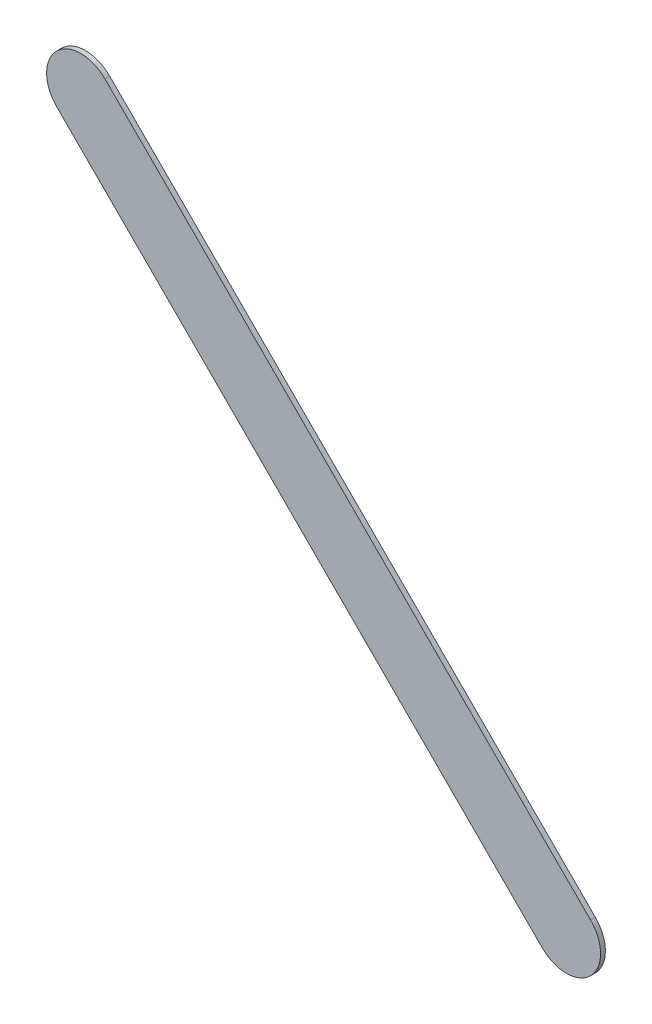
ISO-10303-21;
HEADER;
FILE_DESCRIPTION(('STEP AP214'),'2;1');
FILE_NAME('part.step','',(''),(''),'','','');
FILE_SCHEMA(('AUTOMOTIVE_DESIGN { 1 0 10303 214 1 1 1 1 }'));
ENDSEC;
DATA;
#1=APPLICATION_CONTEXT('core data for automotive mechanical design processes');
#2=APPLICATION_PROTOCOL_DEFINITION('international standard','automotive_design',2000,#1);
#3=PRODUCT_CONTEXT('',#1,'mechanical');
#4=PRODUCT('Part','Part','',(#3));
#5=PRODUCT_RELATED_PRODUCT_CATEGORY('part','',(#4));
#6=PRODUCT_DEFINITION_FORMATION('','',#4);
#7=PRODUCT_DEFINITION_CONTEXT('part definition',#1,'design');
#8=PRODUCT_DEFINITION('design','',#6,#7);
#9=PRODUCT_DEFINITION_SHAPE('','',#8);
#10=(LENGTH_UNIT() NAMED_UNIT(*) SI_UNIT(.MILLI.,.METRE.));
#11=(NAMED_UNIT(*) PLANE_ANGLE_UNIT() SI_UNIT($,.RADIAN.));
#12=(NAMED_UNIT(*) SI_UNIT($,.STERADIAN.) SOLID_ANGLE_UNIT());
#13=UNCERTAINTY_MEASURE_WITH_UNIT(LENGTH_MEASURE(1.E-05),#10,'distance_accuracy_value','');
#14=(GEOMETRIC_REPRESENTATION_CONTEXT(3) GLOBAL_UNCERTAINTY_ASSIGNED_CONTEXT((#13)) GLOBAL_UNIT_ASSIGNED_CONTEXT((#10,
#11,#12)) REPRESENTATION_CONTEXT('',''));
#15=CARTESIAN_POINT('',(0.,0.,0.));
#16=DIRECTION('',(0.,0.,1.));
#17=DIRECTION('',(1.,0.,0.));
#18=AXIS2_PLACEMENT_3D('',#15,#16,#17);
#19=CARTESIAN_POINT('',(148.512776,-91.263223,0.));
#20=DIRECTION('',(0.,0.,1.));
#21=DIRECTION('',(1.,0.,0.));
#22=AXIS2_PLACEMENT_3D('',#19,#20,#21);
#23=PLANE('',#22);
#24=DIRECTION('',(-0.707106781186548,0.707106781186548,0.));
#25=VECTOR('',#24,1.);
#26=CARTESIAN_POINT('',(148.512776,-91.263223,0.));
#27=LINE('',#26,#25);
#28=CARTESIAN_POINT('',(148.512776,-91.263223,0.));
#29=VERTEX_POINT('',#28);
#30=CARTESIAN_POINT('',(144.956776,-87.707223,0.));
#31=VERTEX_POINT('',#30);
#32=EDGE_CURVE('E74',#29,#31,#27,.T.);
#33=ORIENTED_EDGE('',*,*,#32,.T.);
#34=CARTESIAN_POINT('',(144.7799995,-87.8839995,0.));
#35=DIRECTION('',(0.,0.,1.));
#36=DIRECTION('',(0.707106781186548,0.707106781186548,0.));
#37=AXIS2_PLACEMENT_3D('',#34,#35,#36);
#38=CIRCLE('',#37,0.249999723809);
#39=CARTESIAN_POINT('',(144.603223,-88.060776,0.));
#40=VERTEX_POINT('',#39);
#41=EDGE_CURVE('E72',#31,#40,#38,.T.);
#42=ORIENTED_EDGE('',*,*,#41,.T.);
#43=DIRECTION('',(0.707106781186548,-0.707106781186548,0.));
#44=VECTOR('',#43,1.);
#45=CARTESIAN_POINT('',(144.603223,-88.060776,0.));
#46=LINE('',#45,#44);
#47=CARTESIAN_POINT('',(148.159223,-91.616776,0.));
#48=VERTEX_POINT('',#47);
#49=EDGE_CURVE('E60',#40,#48,#46,.T.);
#50=ORIENTED_EDGE('',*,*,#49,.T.);
#51=CARTESIAN_POINT('',(148.3359995,-91.4399995,0.));
#52=DIRECTION('',(0.,0.,1.));
#53=DIRECTION('',(-0.707106781186548,-0.707106781186548,0.));
#54=AXIS2_PLACEMENT_3D('',#51,#52,#53);
#55=CIRCLE('',#54,0.249999723809);
#56=EDGE_CURVE('E11',#48,#29,#55,.T.);
#57=ORIENTED_EDGE('',*,*,#56,.T.);
#58=EDGE_LOOP('',(#33,#42,#50,#57));
#59=FACE_BOUND('',#58,.T.);
#60=ADVANCED_FACE('F17',(#59),#23,.T.);
#61=CARTESIAN_POINT('',(148.512776,-91.263223,-0.035));
#62=DIRECTION('',(0.,0.,1.));
#63=DIRECTION('',(1.,0.,0.));
#64=AXIS2_PLACEMENT_3D('',#61,#62,#63);
#65=PLANE('',#64);
#66=CARTESIAN_POINT('',(148.3359995,-91.4399995,-0.035));
#67=DIRECTION('',(0.,0.,1.));
#68=DIRECTION('',(-0.707106781186548,-0.707106781186548,0.));
#69=AXIS2_PLACEMENT_3D('',#66,#67,#68);
#70=CIRCLE('',#69,0.249999723809);
#71=CARTESIAN_POINT('',(148.159223,-91.616776,-0.035));
#72=VERTEX_POINT('',#71);
#73=CARTESIAN_POINT('',(148.512776,-91.263223,-0.035));
#74=VERTEX_POINT('',#73);
#75=EDGE_CURVE('E26',#72,#74,#70,.T.);
#76=ORIENTED_EDGE('',*,*,#75,.F.);
#77=DIRECTION('',(0.707106781186548,-0.707106781186548,0.));
#78=VECTOR('',#77,1.);
#79=CARTESIAN_POINT('',(144.603223,-88.060776,-0.035));
#80=LINE('',#79,#78);
#81=CARTESIAN_POINT('',(144.603223,-88.060776,-0.035));
#82=VERTEX_POINT('',#81);
#83=EDGE_CURVE('E79',#82,#72,#80,.T.);
#84=ORIENTED_EDGE('',*,*,#83,.F.);
#85=CARTESIAN_POINT('',(144.7799995,-87.8839995,-0.035));
#86=DIRECTION('',(0.,0.,1.));
#87=DIRECTION('',(0.707106781186548,0.707106781186548,0.));
#88=AXIS2_PLACEMENT_3D('',#85,#86,#87);
#89=CIRCLE('',#88,0.249999723809);
#90=CARTESIAN_POINT('',(144.956776,-87.707223,-0.035));
#91=VERTEX_POINT('',#90);
#92=EDGE_CURVE('E83',#91,#82,#89,.T.);
#93=ORIENTED_EDGE('',*,*,#92,.F.);
#94=DIRECTION('',(-0.707106781186548,0.707106781186548,0.));
#95=VECTOR('',#94,1.);
#96=CARTESIAN_POINT('',(148.512776,-91.263223,-0.035));
#97=LINE('',#96,#95);
#98=EDGE_CURVE('E115',#74,#91,#97,.T.);
#99=ORIENTED_EDGE('',*,*,#98,.F.);
#100=EDGE_LOOP('',(#76,#84,#93,#99));
#101=FACE_BOUND('',#100,.T.);
#102=ADVANCED_FACE('F180',(#101),#65,.F.);
#103=CARTESIAN_POINT('',(148.3359995,-91.4399995,-0.035));
#104=DIRECTION('',(0.,0.,-1.));
#105=DIRECTION('',(-0.707106781186548,-0.707106781186548,0.));
#106=AXIS2_PLACEMENT_3D('',#103,#104,#105);
#107=CYLINDRICAL_SURFACE('',#106,0.249999723809);
#108=ORIENTED_EDGE('',*,*,#75,.T.);
#109=DIRECTION('',(0.,0.,1.));
#110=VECTOR('',#109,1.);
#111=CARTESIAN_POINT('',(148.512776,-91.263223,-0.035));
#112=LINE('',#111,#110);
#113=EDGE_CURVE('E90',#74,#29,#112,.T.);
#114=ORIENTED_EDGE('',*,*,#113,.T.);
#115=ORIENTED_EDGE('',*,*,#56,.F.);
#116=DIRECTION('',(0.,0.,1.));
#117=VECTOR('',#116,1.);
#118=CARTESIAN_POINT('',(148.159223,-91.616776,-0.035));
#119=LINE('',#118,#117);
#120=EDGE_CURVE('E67',#72,#48,#119,.T.);
#121=ORIENTED_EDGE('',*,*,#120,.F.);
#122=EDGE_LOOP('',(#108,#114,#115,#121));
#123=FACE_BOUND('',#122,.T.);
#124=ADVANCED_FACE('F171',(#123),#107,.T.);
#125=CARTESIAN_POINT('',(144.603223,-88.060776,-0.035));
#126=DIRECTION('',(0.707106781186548,0.707106781186548,0.));
#127=DIRECTION('',(0.,0.,-1.));
#128=AXIS2_PLACEMENT_3D('',#125,#126,#127);
#129=PLANE('',#128);
#130=ORIENTED_EDGE('',*,*,#83,.T.);
#131=ORIENTED_EDGE('',*,*,#120,.T.);
#132=ORIENTED_EDGE('',*,*,#49,.F.);
#133=DIRECTION('',(0.,0.,1.));
#134=VECTOR('',#133,1.);
#135=CARTESIAN_POINT('',(144.603223,-88.060776,-0.035));
#136=LINE('',#135,#134);
#137=EDGE_CURVE('E65',#82,#40,#136,.T.);
#138=ORIENTED_EDGE('',*,*,#137,.F.);
#139=EDGE_LOOP('',(#130,#131,#132,#138));
#140=FACE_BOUND('',#139,.T.);
#141=ADVANCED_FACE('F63',(#140),#129,.F.);
#142=CARTESIAN_POINT('',(144.7799995,-87.8839995,-0.035));
#143=DIRECTION('',(0.,0.,-1.));
#144=DIRECTION('',(0.707106781186548,0.707106781186548,0.));
#145=AXIS2_PLACEMENT_3D('',#142,#143,#144);
#146=CYLINDRICAL_SURFACE('',#145,0.249999723809);
#147=ORIENTED_EDGE('',*,*,#92,.T.);
#148=ORIENTED_EDGE('',*,*,#137,.T.);
#149=ORIENTED_EDGE('',*,*,#41,.F.);
#150=DIRECTION('',(0.,0.,1.));
#151=VECTOR('',#150,1.);
#152=CARTESIAN_POINT('',(144.956776,-87.707223,-0.035));
#153=LINE('',#152,#151);
#154=EDGE_CURVE('E120',#91,#31,#153,.T.);
#155=ORIENTED_EDGE('',*,*,#154,.F.);
#156=EDGE_LOOP('',(#147,#148,#149,#155));
#157=FACE_BOUND('',#156,.T.);
#158=ADVANCED_FACE('F81',(#157),#146,.T.);
#159=CARTESIAN_POINT('',(148.512776,-91.263223,-0.035));
#160=DIRECTION('',(-0.707106781186548,-0.707106781186548,0.));
#161=DIRECTION('',(-0.707106781186548,0.707106781186548,0.));
#162=AXIS2_PLACEMENT_3D('',#159,#160,#161);
#163=PLANE('',#162);
#164=ORIENTED_EDGE('',*,*,#98,.T.);
#165=ORIENTED_EDGE('',*,*,#154,.T.);
#166=ORIENTED_EDGE('',*,*,#32,.F.);
#167=ORIENTED_EDGE('',*,*,#113,.F.);
#168=EDGE_LOOP('',(#164,#165,#166,#167));
#169=FACE_BOUND('',#168,.T.);
#170=ADVANCED_FACE('F148',(#169),#163,.F.);
#171=CLOSED_SHELL('',(#60,#102,#124,#141,#158,#170));
#172=MANIFOLD_SOLID_BREP('B1',#171);
#173=ADVANCED_BREP_SHAPE_REPRESENTATION('',(#18,#172),#14);
#174=SHAPE_DEFINITION_REPRESENTATION(#9,#173);
ENDSEC;
END-ISO-10303-21;
